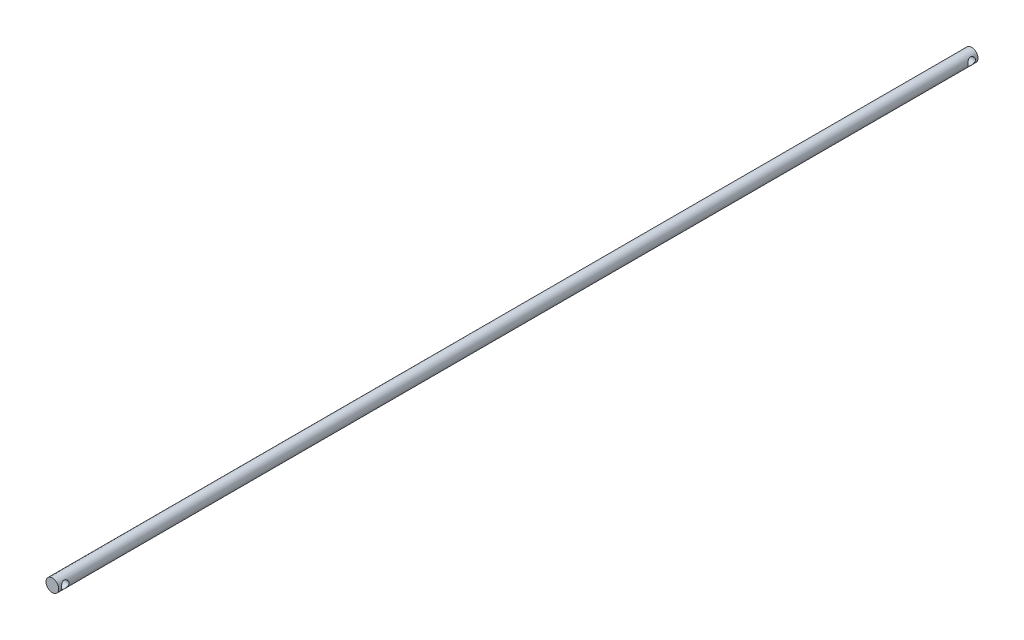
ISO-10303-21;
HEADER;
FILE_DESCRIPTION(('STEP AP214'),'2;1');
FILE_NAME('part.step','',(''),(''),'','','');
FILE_SCHEMA(('AUTOMOTIVE_DESIGN { 1 0 10303 214 1 1 1 1 }'));
ENDSEC;
DATA;
#1=APPLICATION_CONTEXT('core data for automotive mechanical design processes');
#2=APPLICATION_PROTOCOL_DEFINITION('international standard','automotive_design',2000,#1);
#3=PRODUCT_CONTEXT('',#1,'mechanical');
#4=PRODUCT('Part','Part','',(#3));
#5=PRODUCT_RELATED_PRODUCT_CATEGORY('part','',(#4));
#6=PRODUCT_DEFINITION_FORMATION('','',#4);
#7=PRODUCT_DEFINITION_CONTEXT('part definition',#1,'design');
#8=PRODUCT_DEFINITION('design','',#6,#7);
#9=PRODUCT_DEFINITION_SHAPE('','',#8);
#10=(LENGTH_UNIT() NAMED_UNIT(*) SI_UNIT(.MILLI.,.METRE.));
#11=(NAMED_UNIT(*) PLANE_ANGLE_UNIT() SI_UNIT($,.RADIAN.));
#12=(NAMED_UNIT(*) SI_UNIT($,.STERADIAN.) SOLID_ANGLE_UNIT());
#13=UNCERTAINTY_MEASURE_WITH_UNIT(LENGTH_MEASURE(1.E-05),#10,'distance_accuracy_value','');
#14=(GEOMETRIC_REPRESENTATION_CONTEXT(3) GLOBAL_UNCERTAINTY_ASSIGNED_CONTEXT((#13)) GLOBAL_UNIT_ASSIGNED_CONTEXT((#10,
#11,#12)) REPRESENTATION_CONTEXT('',''));
#15=CARTESIAN_POINT('',(0.,0.,0.));
#16=DIRECTION('',(0.,0.,1.));
#17=DIRECTION('',(1.,0.,0.));
#18=AXIS2_PLACEMENT_3D('',#15,#16,#17);
#19=CARTESIAN_POINT('',(0.,0.,360.));
#20=DIRECTION('',(0.,0.,-1.));
#21=DIRECTION('',(-1.,0.,0.));
#22=AXIS2_PLACEMENT_3D('',#19,#20,#21);
#23=CYLINDRICAL_SURFACE('',#22,2.5);
#24=CARTESIAN_POINT('',(-2.5,0.,355.935271275147));
#25=CARTESIAN_POINT('',(-2.49999625789732,0.0767298334620175,355.935275366156));
#26=CARTESIAN_POINT('',(-2.4964290461501,0.153582320644183,355.941199946073));
#27=CARTESIAN_POINT('',(-2.48249903608567,0.30497550953069,355.964595594662));
#28=CARTESIAN_POINT('',(-2.47211948032718,0.37951003459606,355.982095137001));
#29=CARTESIAN_POINT('',(-2.44561558054488,0.523751827790841,356.027657636313));
#30=CARTESIAN_POINT('',(-2.42951973272944,0.593481028226558,356.05566823331));
#31=CARTESIAN_POINT('',(-2.39295367626407,0.727030318214654,356.121131608288));
#32=CARTESIAN_POINT('',(-2.37248455380254,0.790851869416392,356.158582042115));
#33=CARTESIAN_POINT('',(-2.32705360719087,0.91629927899934,356.245046101855));
#34=CARTESIAN_POINT('',(-2.30186792195984,0.977384020081438,356.294724970498));
#35=CARTESIAN_POINT('',(-2.25030439279633,1.09088270411892,356.402738478975));
#36=CARTESIAN_POINT('',(-2.2239250515357,1.14328534948113,356.461084212334));
#37=CARTESIAN_POINT('',(-2.1691106699591,1.24444996762975,356.593194785643));
#38=CARTESIAN_POINT('',(-2.14082017703648,1.2919776637881,356.667973046128));
#39=CARTESIAN_POINT('',(-2.08938301412122,1.37361437764898,356.82611784839));
#40=CARTESIAN_POINT('',(-2.06622802273936,1.40774517335162,356.909470171394));
#41=CARTESIAN_POINT('',(-2.03354629660928,1.45440601714224,357.0618677258));
#42=CARTESIAN_POINT('',(-2.02207883137589,1.47016197246829,357.129507273757));
#43=CARTESIAN_POINT('',(-2.00590308295501,1.49216172340478,357.267074990977));
#44=CARTESIAN_POINT('',(-2.00118639643758,1.49841734556838,357.337000203901));
#45=CARTESIAN_POINT('',(-1.99920922463854,1.50105508796011,357.477282769364));
#46=CARTESIAN_POINT('',(-2.00196337012716,1.49741783408421,357.54764070024));
#47=CARTESIAN_POINT('',(-2.01453261443739,1.48046060478831,357.686550050574));
#48=CARTESIAN_POINT('',(-2.02435302432224,1.46713334620105,357.755100070994));
#49=CARTESIAN_POINT('',(-2.04953186944256,1.43173921881795,357.887801517275));
#50=CARTESIAN_POINT('',(-2.06481711652535,1.4097874866609,357.951998329071));
#51=CARTESIAN_POINT('',(-2.09927051350825,1.35795061770842,358.075966266075));
#52=CARTESIAN_POINT('',(-2.11844008623462,1.3280625725971,358.13573575857));
#53=CARTESIAN_POINT('',(-2.16255327268981,1.25517983184589,358.260255372269));
#54=CARTESIAN_POINT('',(-2.18792043372988,1.21080724397731,358.324049368101));
#55=CARTESIAN_POINT('',(-2.23930599764377,1.11291092784012,358.443947758814));
#56=CARTESIAN_POINT('',(-2.26532500262145,1.05937845100587,358.500044709123));
#57=CARTESIAN_POINT('',(-2.31935504958314,0.935811834383042,358.610884256968));
#58=CARTESIAN_POINT('',(-2.3471383626853,0.864517682705036,358.664348581163));
#59=CARTESIAN_POINT('',(-2.39772428433978,0.712276050459076,358.758393322344));
#60=CARTESIAN_POINT('',(-2.42052955425513,0.631333763943633,358.798980628936));
#61=CARTESIAN_POINT('',(-2.4573039206615,0.46719758526827,358.863203457942));
#62=CARTESIAN_POINT('',(-2.47173957439703,0.384467624173644,358.887746630862));
#63=CARTESIAN_POINT('',(-2.4921884281355,0.215047895144702,358.922282472552));
#64=CARTESIAN_POINT('',(-2.49821172952737,0.12836300566138,358.9322925929));
#65=CARTESIAN_POINT('',(-2.5009057037461,-0.0337146143773399,358.936779122825));
#66=CARTESIAN_POINT('',(-2.49873521714286,-0.109042473418664,358.933180130232));
#67=CARTESIAN_POINT('',(-2.48778712087049,-0.257829401986009,358.914845422075));
#68=CARTESIAN_POINT('',(-2.47900964518038,-0.331288509376054,358.900109932341));
#69=CARTESIAN_POINT('',(-2.45594792442191,-0.472574932157559,358.860727842334));
#70=CARTESIAN_POINT('',(-2.44180275662556,-0.540495750928427,358.836330926073));
#71=CARTESIAN_POINT('',(-2.40913880862846,-0.671265749087212,358.778593898781));
#72=CARTESIAN_POINT('',(-2.39061916586513,-0.734113924963864,358.7452520238));
#73=CARTESIAN_POINT('',(-2.34845496237362,-0.860006262823816,358.666714295938));
#74=CARTESIAN_POINT('',(-2.32447802739882,-0.92239415045678,358.620647446068));
#75=CARTESIAN_POINT('',(-2.27474265574734,-1.03902603131009,358.519879881658));
#76=CARTESIAN_POINT('',(-2.24898216586362,-1.09326040273736,358.465169120294));
#77=CARTESIAN_POINT('',(-2.19445423909892,-1.19931996735578,358.34036088511));
#78=CARTESIAN_POINT('',(-2.16573241746293,-1.24991019630912,358.269187389681));
#79=CARTESIAN_POINT('',(-2.11216182066712,-1.33845238915664,358.118055250578));
#80=CARTESIAN_POINT('',(-2.08730897997691,-1.37641766769779,358.038105981254));
#81=CARTESIAN_POINT('',(-2.04984909240519,-1.43142578795776,357.88902825284));
#82=CARTESIAN_POINT('',(-2.03575659328728,-1.45121625336191,357.821290962788));
#83=CARTESIAN_POINT('',(-2.01409605743543,-1.48113663905973,357.682739197067));
#84=CARTESIAN_POINT('',(-2.0065189764272,-1.49127995297632,357.611929130819));
#85=CARTESIAN_POINT('',(-1.99900446616266,-1.50134130416633,357.46889432755));
#86=CARTESIAN_POINT('',(-1.99909576445935,-1.50122089107872,357.39666528446));
#87=CARTESIAN_POINT('',(-2.00697717892848,-1.4906647295933,357.253376839537));
#88=CARTESIAN_POINT('',(-2.01477148138818,-1.48022337215761,357.182318095066));
#89=CARTESIAN_POINT('',(-2.03633185242978,-1.45040174148915,357.046782857574));
#90=CARTESIAN_POINT('',(-2.04979211805579,-1.43147636845353,356.98215418084));
#91=CARTESIAN_POINT('',(-2.0810550196015,-1.38563242076995,356.856934020672));
#92=CARTESIAN_POINT('',(-2.09885929040481,-1.35871083588482,356.796344068186));
#93=CARTESIAN_POINT('',(-2.14012990550915,-1.29289245555735,356.670951417926));
#94=CARTESIAN_POINT('',(-2.16404587582638,-1.25279167675756,356.606930171292));
#95=CARTESIAN_POINT('',(-2.21320127030766,-1.16375698389088,356.485891202529));
#96=CARTESIAN_POINT('',(-2.23844177205019,-1.11481579607802,356.428879312994));
#97=CARTESIAN_POINT('',(-2.29225690291474,-1.00009777425738,356.313920326015));
#98=CARTESIAN_POINT('',(-2.32070308663656,-0.932876819313945,356.25734020025));
#99=CARTESIAN_POINT('',(-2.37365428872366,-0.788462434445632,356.156173419283));
#100=CARTESIAN_POINT('',(-2.39815789310934,-0.711265444501585,356.111591063162));
#101=CARTESIAN_POINT('',(-2.43985578654393,-0.551125230801487,356.037485467573));
#102=CARTESIAN_POINT('',(-2.45725077479786,-0.468430086957234,356.00754321022));
#103=CARTESIAN_POINT('',(-2.48366273001246,-0.297973306118822,355.962546579936));
#104=CARTESIAN_POINT('',(-2.49271125871485,-0.210232099648635,355.947436107289));
#105=CARTESIAN_POINT('',(-2.49802001168187,-0.101558096917556,355.938573820438));
#106=CARTESIAN_POINT('',(-2.49876114656362,-0.0812762590282931,355.93733685784));
#107=CARTESIAN_POINT('',(-2.49975164517367,-0.0406658206871201,355.935685028776));
#108=CARTESIAN_POINT('',(-2.50000099184316,-0.0203372186375734,355.935270190826));
#109=CARTESIAN_POINT('',(-2.5,0.,355.935271275147));
#110=B_SPLINE_CURVE_WITH_KNOTS('',3,(#24,#25,#26,#27,#28,#29,#30,#31,#32,#33,#34,#35,#36,#37,
#38,#39,#40,#41,#42,#43,#44,#45,#46,#47,#48,#49,#50,#51,#52,#53,#54,#55,#56,#57,#58,#59,#60,#61,
#62,#63,#64,#65,#66,#67,#68,#69,#70,#71,#72,#73,#74,#75,#76,#77,#78,#79,#80,#81,#82,#83,#84,#85,
#86,#87,#88,#89,#90,#91,#92,#93,#94,#95,#96,#97,#98,#99,#100,#101,#102,#103,#104,#105,#106,#107,
#108,#109),.UNSPECIFIED.,.T.,.F.,(4,2,2,2,2,2,2,2,2,2,2,2,2,2,2,2,2,2,2,2,2,2,2,2,2,2,2,2,2,2,2,
2,2,2,2,2,2,2,2,2,2,2,4),(0.,0.230102237548654,0.46077262752002,0.690308884600017,
0.919788197992278,1.16681590732477,1.41416257934802,1.69183813189808,1.96906040692097,
2.17933829855637,2.38935420916578,2.59978170870725,2.81036753273876,3.01823267593204,
3.22617409809866,3.47046995225159,3.71500044803672,3.9936095788469,4.27206939275324,
4.53296790696561,4.79355286918237,5.01875602722429,5.24395461863457,5.46367785689772,
5.68344445659026,5.92601365818363,6.1688669008184,6.4433676242801,6.71757792616458,
6.93257787314697,7.14727888733324,7.36278425777444,7.57840681155737,7.78364098331153,
7.98895251523051,8.22578610052296,8.4628154437022,8.73854311775528,9.01436946031996,
9.28175654462691,9.54812832184462,9.60911473335192,9.67010326027656),.UNSPECIFIED.);
#111=CARTESIAN_POINT('',(-2.5,0.,355.935271275147));
#112=VERTEX_POINT('',#111);
#113=EDGE_CURVE('E10',#112,#112,#110,.T.);
#114=ORIENTED_EDGE('',*,*,#113,.T.);
#115=EDGE_LOOP('',(#114));
#116=FACE_BOUND('',#115,.T.);
#117=CARTESIAN_POINT('',(2.5,0.,355.935271275147));
#118=CARTESIAN_POINT('',(2.49999625789732,-0.0767298334620175,355.935275366156));
#119=CARTESIAN_POINT('',(2.4964290461501,-0.153582320644183,355.941199946073));
#120=CARTESIAN_POINT('',(2.48249903608567,-0.30497550953069,355.964595594662));
#121=CARTESIAN_POINT('',(2.47211948032718,-0.37951003459606,355.982095137001));
#122=CARTESIAN_POINT('',(2.44561558054488,-0.523751827790841,356.027657636313));
#123=CARTESIAN_POINT('',(2.42951973272944,-0.593481028226558,356.05566823331));
#124=CARTESIAN_POINT('',(2.39295367626407,-0.727030318214654,356.121131608288));
#125=CARTESIAN_POINT('',(2.37248455380254,-0.790851869416392,356.158582042115));
#126=CARTESIAN_POINT('',(2.32705360719087,-0.91629927899934,356.245046101855));
#127=CARTESIAN_POINT('',(2.30186792195984,-0.977384020081438,356.294724970498));
#128=CARTESIAN_POINT('',(2.25030439279633,-1.09088270411892,356.402738478975));
#129=CARTESIAN_POINT('',(2.2239250515357,-1.14328534948113,356.461084212334));
#130=CARTESIAN_POINT('',(2.1691106699591,-1.24444996762975,356.593194785643));
#131=CARTESIAN_POINT('',(2.14082017703648,-1.2919776637881,356.667973046128));
#132=CARTESIAN_POINT('',(2.08938301412122,-1.37361437764898,356.82611784839));
#133=CARTESIAN_POINT('',(2.06622802273936,-1.40774517335162,356.909470171394));
#134=CARTESIAN_POINT('',(2.03354629660928,-1.45440601714224,357.0618677258));
#135=CARTESIAN_POINT('',(2.02207883137589,-1.47016197246829,357.129507273757));
#136=CARTESIAN_POINT('',(2.00590308295501,-1.49216172340478,357.267074990977));
#137=CARTESIAN_POINT('',(2.00118639643758,-1.49841734556838,357.337000203901));
#138=CARTESIAN_POINT('',(1.99920922463854,-1.50105508796011,357.477282769364));
#139=CARTESIAN_POINT('',(2.00196337012716,-1.49741783408421,357.54764070024));
#140=CARTESIAN_POINT('',(2.01453261443739,-1.48046060478831,357.686550050574));
#141=CARTESIAN_POINT('',(2.02435302432224,-1.46713334620105,357.755100070994));
#142=CARTESIAN_POINT('',(2.04953186944256,-1.43173921881795,357.887801517275));
#143=CARTESIAN_POINT('',(2.06481711652535,-1.4097874866609,357.951998329071));
#144=CARTESIAN_POINT('',(2.09927051350825,-1.35795061770842,358.075966266075));
#145=CARTESIAN_POINT('',(2.11844008623462,-1.3280625725971,358.13573575857));
#146=CARTESIAN_POINT('',(2.16255327268981,-1.25517983184589,358.260255372269));
#147=CARTESIAN_POINT('',(2.18792043372988,-1.21080724397731,358.324049368101));
#148=CARTESIAN_POINT('',(2.23930599764377,-1.11291092784012,358.443947758814));
#149=CARTESIAN_POINT('',(2.26532500262145,-1.05937845100587,358.500044709123));
#150=CARTESIAN_POINT('',(2.31935504958314,-0.935811834383042,358.610884256968));
#151=CARTESIAN_POINT('',(2.3471383626853,-0.864517682705036,358.664348581163));
#152=CARTESIAN_POINT('',(2.39772428433978,-0.712276050459076,358.758393322344));
#153=CARTESIAN_POINT('',(2.42052955425513,-0.631333763943633,358.798980628936));
#154=CARTESIAN_POINT('',(2.4573039206615,-0.46719758526827,358.863203457942));
#155=CARTESIAN_POINT('',(2.47173957439703,-0.384467624173644,358.887746630862));
#156=CARTESIAN_POINT('',(2.4921884281355,-0.215047895144702,358.922282472552));
#157=CARTESIAN_POINT('',(2.49821172952737,-0.12836300566138,358.9322925929));
#158=CARTESIAN_POINT('',(2.5009057037461,0.0337146143773399,358.936779122825));
#159=CARTESIAN_POINT('',(2.49873521714286,0.109042473418664,358.933180130232));
#160=CARTESIAN_POINT('',(2.48778712087049,0.257829401986009,358.914845422075));
#161=CARTESIAN_POINT('',(2.47900964518038,0.331288509376054,358.900109932341));
#162=CARTESIAN_POINT('',(2.45594792442191,0.472574932157559,358.860727842334));
#163=CARTESIAN_POINT('',(2.44180275662556,0.540495750928427,358.836330926073));
#164=CARTESIAN_POINT('',(2.40913880862846,0.671265749087212,358.778593898781));
#165=CARTESIAN_POINT('',(2.39061916586513,0.734113924963864,358.7452520238));
#166=CARTESIAN_POINT('',(2.34845496237362,0.860006262823816,358.666714295938));
#167=CARTESIAN_POINT('',(2.32447802739882,0.92239415045678,358.620647446068));
#168=CARTESIAN_POINT('',(2.27474265574734,1.03902603131009,358.519879881658));
#169=CARTESIAN_POINT('',(2.24898216586362,1.09326040273736,358.465169120294));
#170=CARTESIAN_POINT('',(2.19445423909892,1.19931996735578,358.34036088511));
#171=CARTESIAN_POINT('',(2.16573241746293,1.24991019630912,358.269187389681));
#172=CARTESIAN_POINT('',(2.11216182066712,1.33845238915664,358.118055250578));
#173=CARTESIAN_POINT('',(2.08730897997691,1.37641766769779,358.038105981254));
#174=CARTESIAN_POINT('',(2.04984909240519,1.43142578795776,357.88902825284));
#175=CARTESIAN_POINT('',(2.03575659328728,1.45121625336191,357.821290962788));
#176=CARTESIAN_POINT('',(2.01409605743543,1.48113663905973,357.682739197067));
#177=CARTESIAN_POINT('',(2.0065189764272,1.49127995297632,357.611929130819));
#178=CARTESIAN_POINT('',(1.99900446616266,1.50134130416633,357.46889432755));
#179=CARTESIAN_POINT('',(1.99909576445935,1.50122089107872,357.39666528446));
#180=CARTESIAN_POINT('',(2.00697717892848,1.4906647295933,357.253376839537));
#181=CARTESIAN_POINT('',(2.01477148138818,1.48022337215761,357.182318095066));
#182=CARTESIAN_POINT('',(2.03633185242978,1.45040174148915,357.046782857574));
#183=CARTESIAN_POINT('',(2.04979211805579,1.43147636845353,356.98215418084));
#184=CARTESIAN_POINT('',(2.0810550196015,1.38563242076995,356.856934020672));
#185=CARTESIAN_POINT('',(2.09885929040481,1.35871083588482,356.796344068186));
#186=CARTESIAN_POINT('',(2.14012990550915,1.29289245555735,356.670951417926));
#187=CARTESIAN_POINT('',(2.16404587582638,1.25279167675756,356.606930171292));
#188=CARTESIAN_POINT('',(2.21320127030766,1.16375698389088,356.485891202529));
#189=CARTESIAN_POINT('',(2.23844177205019,1.11481579607802,356.428879312994));
#190=CARTESIAN_POINT('',(2.29225690291474,1.00009777425738,356.313920326015));
#191=CARTESIAN_POINT('',(2.32070308663656,0.932876819313945,356.25734020025));
#192=CARTESIAN_POINT('',(2.37365428872366,0.788462434445632,356.156173419283));
#193=CARTESIAN_POINT('',(2.39815789310934,0.711265444501585,356.111591063162));
#194=CARTESIAN_POINT('',(2.43985578654393,0.551125230801487,356.037485467573));
#195=CARTESIAN_POINT('',(2.45725077479786,0.468430086957234,356.00754321022));
#196=CARTESIAN_POINT('',(2.48366273001246,0.297973306118822,355.962546579936));
#197=CARTESIAN_POINT('',(2.49271125871485,0.210232099648635,355.947436107289));
#198=CARTESIAN_POINT('',(2.49802001168187,0.101558096917556,355.938573820438));
#199=CARTESIAN_POINT('',(2.49876114656362,0.0812762590282931,355.93733685784));
#200=CARTESIAN_POINT('',(2.49975164517367,0.0406658206871201,355.935685028776));
#201=CARTESIAN_POINT('',(2.50000099184316,0.0203372186375734,355.935270190826));
#202=CARTESIAN_POINT('',(2.5,0.,355.935271275147));
#203=B_SPLINE_CURVE_WITH_KNOTS('',3,(#117,#118,#119,#120,#121,#122,#123,#124,#125,#126,#127,
#128,#129,#130,#131,#132,#133,#134,#135,#136,#137,#138,#139,#140,#141,#142,#143,#144,#145,#146,
#147,#148,#149,#150,#151,#152,#153,#154,#155,#156,#157,#158,#159,#160,#161,#162,#163,#164,#165,
#166,#167,#168,#169,#170,#171,#172,#173,#174,#175,#176,#177,#178,#179,#180,#181,#182,#183,#184,
#185,#186,#187,#188,#189,#190,#191,#192,#193,#194,#195,#196,#197,#198,#199,#200,#201,#202),
.UNSPECIFIED.,.T.,.F.,(4,2,2,2,2,2,2,2,2,2,2,2,2,2,2,2,2,2,2,2,2,2,2,2,2,2,2,2,2,2,2,2,2,2,2,2,
2,2,2,2,2,2,4),(0.,0.230102237548654,0.46077262752002,0.690308884600017,0.919788197992278,
1.16681590732477,1.41416257934802,1.69183813189808,1.96906040692097,2.17933829855637,
2.38935420916578,2.59978170870725,2.81036753273876,3.01823267593204,3.22617409809866,
3.47046995225159,3.71500044803672,3.9936095788469,4.27206939275324,4.53296790696561,
4.79355286918237,5.01875602722429,5.24395461863457,5.46367785689772,5.68344445659026,
5.92601365818363,6.1688669008184,6.4433676242801,6.71757792616458,6.93257787314697,
7.14727888733324,7.36278425777444,7.57840681155737,7.78364098331153,7.98895251523051,
8.22578610052296,8.4628154437022,8.73854311775528,9.01436946031996,9.28175654462691,
9.54812832184462,9.60911473335192,9.67010326027656),.UNSPECIFIED.);
#204=CARTESIAN_POINT('',(2.5,0.,355.935271275147));
#205=VERTEX_POINT('',#204);
#206=EDGE_CURVE('E50',#205,#205,#203,.T.);
#207=ORIENTED_EDGE('',*,*,#206,.T.);
#208=EDGE_LOOP('',(#207));
#209=FACE_BOUND('',#208,.T.);
#210=CARTESIAN_POINT('',(-2.5,0.,0.995637839981524));
#211=CARTESIAN_POINT('',(-2.49999625789732,0.0767298334620168,0.995641930991403));
#212=CARTESIAN_POINT('',(-2.4964290461501,0.15358232064418,1.00156651090779));
#213=CARTESIAN_POINT('',(-2.48249903608568,0.304975509530683,1.02496215949685));
#214=CARTESIAN_POINT('',(-2.47211948032719,0.379510034596052,1.04246170183575));
#215=CARTESIAN_POINT('',(-2.44561558054488,0.523751827790843,1.08802420114838));
#216=CARTESIAN_POINT('',(-2.42951973272943,0.593481028226573,1.11603479814468));
#217=CARTESIAN_POINT('',(-2.39295367626407,0.727030318214667,1.18149817312256));
#218=CARTESIAN_POINT('',(-2.37248455380255,0.790851869416392,1.21894860695027));
#219=CARTESIAN_POINT('',(-2.32705360719087,0.916299278999325,1.30541266669011));
#220=CARTESIAN_POINT('',(-2.30186792195984,0.977384020081426,1.35509153533292));
#221=CARTESIAN_POINT('',(-2.25030439279633,1.09088270411892,1.46310504380981));
#222=CARTESIAN_POINT('',(-2.2239250515357,1.14328534948113,1.52145077716885));
#223=CARTESIAN_POINT('',(-2.1691106699591,1.24444996762975,1.65356135047827));
#224=CARTESIAN_POINT('',(-2.14082017703649,1.2919776637881,1.72833961096282));
#225=CARTESIAN_POINT('',(-2.08938301412123,1.37361437764897,1.88648441322465));
#226=CARTESIAN_POINT('',(-2.06622802273937,1.4077451733516,1.9698367362291));
#227=CARTESIAN_POINT('',(-2.0335462966093,1.45440601714222,2.12223429063477));
#228=CARTESIAN_POINT('',(-2.02207883137591,1.47016197246827,2.18987383859185));
#229=CARTESIAN_POINT('',(-2.00590308295503,1.49216172340475,2.32744155581189));
#230=CARTESIAN_POINT('',(-2.00118639643759,1.49841734556836,2.39736676873602));
#231=CARTESIAN_POINT('',(-1.99920922463856,1.50105508796009,2.53764933419886));
#232=CARTESIAN_POINT('',(-2.00196337012718,1.49741783408418,2.60800726507472));
#233=CARTESIAN_POINT('',(-2.01453261443741,1.48046060478828,2.74691661540911));
#234=CARTESIAN_POINT('',(-2.02435302432226,1.46713334620103,2.81546663582897));
#235=CARTESIAN_POINT('',(-2.04953186944258,1.43173921881792,2.94816808210963));
#236=CARTESIAN_POINT('',(-2.06481711652537,1.40978748666087,3.01236489390601));
#237=CARTESIAN_POINT('',(-2.09927051350828,1.35795061770837,3.13633283090965));
#238=CARTESIAN_POINT('',(-2.11844008623465,1.32806257259705,3.19610232340545));
#239=CARTESIAN_POINT('',(-2.16255327268985,1.25517983184582,3.32062193710433));
#240=CARTESIAN_POINT('',(-2.18792043372992,1.21080724397722,3.38441593293646));
#241=CARTESIAN_POINT('',(-2.23930599764382,1.11291092784002,3.50431432364855));
#242=CARTESIAN_POINT('',(-2.2653250026215,1.05937845100577,3.56041127395804));
#243=CARTESIAN_POINT('',(-2.31935504958317,0.935811834382947,3.6712508218033));
#244=CARTESIAN_POINT('',(-2.34713836268533,0.864517682704935,3.72471514599753));
#245=CARTESIAN_POINT('',(-2.39772428433981,0.712276050458972,3.81875988717945));
#246=CARTESIAN_POINT('',(-2.42052955425516,0.631333763943532,3.85934719377149));
#247=CARTESIAN_POINT('',(-2.45730392066152,0.467197585268171,3.92357002277743));
#248=CARTESIAN_POINT('',(-2.47173957439704,0.384467624173545,3.94811319569745));
#249=CARTESIAN_POINT('',(-2.49218842813551,0.215047895144605,3.98264903738691));
#250=CARTESIAN_POINT('',(-2.49821172952738,0.128363005661285,3.9926591577351));
#251=CARTESIAN_POINT('',(-2.5009057037461,-0.0337146143774281,3.99714568765983));
#252=CARTESIAN_POINT('',(-2.49873521714286,-0.109042473418747,3.99354669506669));
#253=CARTESIAN_POINT('',(-2.48778712087048,-0.257829401986086,3.9752119869096));
#254=CARTESIAN_POINT('',(-2.47900964518037,-0.331288509376129,3.96047649717571));
#255=CARTESIAN_POINT('',(-2.4559479244219,-0.472574932157632,3.92109440716905));
#256=CARTESIAN_POINT('',(-2.44180275662555,-0.540495750928502,3.89669749090805));
#257=CARTESIAN_POINT('',(-2.40913880862844,-0.671265749087278,3.83896046361625));
#258=CARTESIAN_POINT('',(-2.39061916586511,-0.734113924963922,3.80561858863484));
#259=CARTESIAN_POINT('',(-2.3484549623736,-0.860006262823875,3.72708086077281));
#260=CARTESIAN_POINT('',(-2.32447802739879,-0.922394150456848,3.68101401090312));
#261=CARTESIAN_POINT('',(-2.27474265574731,-1.03902603131015,3.5802464464929));
#262=CARTESIAN_POINT('',(-2.2489821658636,-1.09326040273739,3.52553568512898));
#263=CARTESIAN_POINT('',(-2.1944542390989,-1.1993199673558,3.40072744994436));
#264=CARTESIAN_POINT('',(-2.16573241746291,-1.24991019630916,3.32955395451601));
#265=CARTESIAN_POINT('',(-2.11216182066709,-1.33845238915668,3.1784218154133));
#266=CARTESIAN_POINT('',(-2.08730897997689,-1.37641766769782,3.09847254608872));
#267=CARTESIAN_POINT('',(-2.04984909240519,-1.43142578795777,2.94939481767481));
#268=CARTESIAN_POINT('',(-2.03575659328728,-1.45121625336191,2.88165752762291));
#269=CARTESIAN_POINT('',(-2.01409605743543,-1.48113663905972,2.7431057619014));
#270=CARTESIAN_POINT('',(-2.0065189764272,-1.49127995297631,2.67229569565367));
#271=CARTESIAN_POINT('',(-1.99900446616268,-1.50134130416631,2.52926089238447));
#272=CARTESIAN_POINT('',(-1.99909576445937,-1.50122089107869,2.45703184929445));
#273=CARTESIAN_POINT('',(-2.0069771789285,-1.49066472959327,2.31374340437204));
#274=CARTESIAN_POINT('',(-2.01477148138821,-1.48022337215758,2.2426846599009));
#275=CARTESIAN_POINT('',(-2.03633185242981,-1.45040174148912,2.10714942240931));
#276=CARTESIAN_POINT('',(-2.04979211805581,-1.4314763684535,2.04252074567463));
#277=CARTESIAN_POINT('',(-2.08105501960152,-1.38563242076992,1.91730058550728));
#278=CARTESIAN_POINT('',(-2.09885929040483,-1.35871083588478,1.85671063302095));
#279=CARTESIAN_POINT('',(-2.14012990550917,-1.29289245555731,1.73131798276072));
#280=CARTESIAN_POINT('',(-2.1640458758264,-1.25279167675752,1.6672967361272));
#281=CARTESIAN_POINT('',(-2.21320127030768,-1.16375698389083,1.54625776736422));
#282=CARTESIAN_POINT('',(-2.23844177205022,-1.11481579607797,1.48924587782896));
#283=CARTESIAN_POINT('',(-2.29225690291477,-1.00009777425733,1.37428689084984));
#284=CARTESIAN_POINT('',(-2.32070308663658,-0.932876819313896,1.31770676508533));
#285=CARTESIAN_POINT('',(-2.37365428872367,-0.788462434445585,1.21653998411822));
#286=CARTESIAN_POINT('',(-2.39815789310936,-0.711265444501538,1.17195762799673));
#287=CARTESIAN_POINT('',(-2.43985578654394,-0.551125230801454,1.09785203240779));
#288=CARTESIAN_POINT('',(-2.45725077479787,-0.468430086957215,1.0679097750547));
#289=CARTESIAN_POINT('',(-2.48366273001246,-0.297973306118809,1.02291314477055));
#290=CARTESIAN_POINT('',(-2.49271125871485,-0.210232099648615,1.00780267212453));
#291=CARTESIAN_POINT('',(-2.49802001168187,-0.101558096917538,0.998940385272865));
#292=CARTESIAN_POINT('',(-2.49876114656362,-0.0812762590282788,0.997703422675428));
#293=CARTESIAN_POINT('',(-2.49975164517367,-0.0406658206871127,0.99605159361066));
#294=CARTESIAN_POINT('',(-2.50000099184316,-0.0203372186375696,0.99563675566062));
#295=CARTESIAN_POINT('',(-2.5,0.,0.995637839981524));
#296=B_SPLINE_CURVE_WITH_KNOTS('',3,(#210,#211,#212,#213,#214,#215,#216,#217,#218,#219,#220,
#221,#222,#223,#224,#225,#226,#227,#228,#229,#230,#231,#232,#233,#234,#235,#236,#237,#238,#239,
#240,#241,#242,#243,#244,#245,#246,#247,#248,#249,#250,#251,#252,#253,#254,#255,#256,#257,#258,
#259,#260,#261,#262,#263,#264,#265,#266,#267,#268,#269,#270,#271,#272,#273,#274,#275,#276,#277,
#278,#279,#280,#281,#282,#283,#284,#285,#286,#287,#288,#289,#290,#291,#292,#293,#294,#295),
.UNSPECIFIED.,.T.,.F.,(4,2,2,2,2,2,2,2,2,2,2,2,2,2,2,2,2,2,2,2,2,2,2,2,2,2,2,2,2,2,2,2,2,2,2,2,
2,2,2,2,2,2,4),(0.,0.230102237548652,0.460772627520018,0.690308884600021,0.919788197992287,
1.16681590732474,1.41416257934802,1.69183813189809,1.96906040692092,2.17933829855634,
2.38935420916578,2.59978170870726,2.81036753273872,3.01823267593207,3.22617409809869,
3.47046995225164,3.71500044803676,3.99360957884694,4.27206939275328,4.53296790696563,
4.79355286918239,5.01875602722429,5.24395461863457,5.46367785689774,5.68344445659027,
5.92601365818363,6.16886690081837,6.44336762428011,6.71757792616458,6.93257787314695,
7.14727888733321,7.36278425777436,7.57840681155728,7.78364098331145,7.98895251523038,
8.22578610052288,8.46281544370209,8.7385431177552,9.01436946031985,9.28175654462677,
9.54812832184448,9.60911473335177,9.67010326027641),.UNSPECIFIED.);
#297=CARTESIAN_POINT('',(-2.5,0.,0.995637839981524));
#298=VERTEX_POINT('',#297);
#299=EDGE_CURVE('E54',#298,#298,#296,.T.);
#300=ORIENTED_EDGE('',*,*,#299,.T.);
#301=EDGE_LOOP('',(#300));
#302=FACE_BOUND('',#301,.T.);
#303=CARTESIAN_POINT('',(2.5,0.,0.995637839981524));
#304=CARTESIAN_POINT('',(2.49999625789732,-0.0767298334620168,0.995641930991403));
#305=CARTESIAN_POINT('',(2.4964290461501,-0.15358232064418,1.00156651090779));
#306=CARTESIAN_POINT('',(2.48249903608568,-0.304975509530683,1.02496215949685));
#307=CARTESIAN_POINT('',(2.47211948032719,-0.379510034596052,1.04246170183575));
#308=CARTESIAN_POINT('',(2.44561558054488,-0.523751827790843,1.08802420114838));
#309=CARTESIAN_POINT('',(2.42951973272943,-0.593481028226573,1.11603479814468));
#310=CARTESIAN_POINT('',(2.39295367626407,-0.727030318214667,1.18149817312256));
#311=CARTESIAN_POINT('',(2.37248455380255,-0.790851869416392,1.21894860695027));
#312=CARTESIAN_POINT('',(2.32705360719087,-0.916299278999325,1.30541266669011));
#313=CARTESIAN_POINT('',(2.30186792195985,-0.977384020081425,1.35509153533292));
#314=CARTESIAN_POINT('',(2.25030439279633,-1.09088270411892,1.46310504380981));
#315=CARTESIAN_POINT('',(2.2239250515357,-1.14328534948113,1.52145077716885));
#316=CARTESIAN_POINT('',(2.1691106699591,-1.24444996762975,1.65356135047827));
#317=CARTESIAN_POINT('',(2.14082017703649,-1.2919776637881,1.72833961096282));
#318=CARTESIAN_POINT('',(2.08938301412123,-1.37361437764897,1.88648441322465));
#319=CARTESIAN_POINT('',(2.06622802273937,-1.4077451733516,1.9698367362291));
#320=CARTESIAN_POINT('',(2.0335462966093,-1.45440601714222,2.12223429063477));
#321=CARTESIAN_POINT('',(2.02207883137591,-1.47016197246827,2.18987383859185));
#322=CARTESIAN_POINT('',(2.00590308295503,-1.49216172340475,2.32744155581189));
#323=CARTESIAN_POINT('',(2.00118639643759,-1.49841734556836,2.39736676873602));
#324=CARTESIAN_POINT('',(1.99920922463856,-1.50105508796009,2.53764933419886));
#325=CARTESIAN_POINT('',(2.00196337012718,-1.49741783408419,2.60800726507472));
#326=CARTESIAN_POINT('',(2.01453261443741,-1.48046060478828,2.74691661540911));
#327=CARTESIAN_POINT('',(2.02435302432226,-1.46713334620103,2.81546663582897));
#328=CARTESIAN_POINT('',(2.04953186944258,-1.43173921881792,2.94816808210963));
#329=CARTESIAN_POINT('',(2.06481711652537,-1.40978748666087,3.01236489390601));
#330=CARTESIAN_POINT('',(2.09927051350828,-1.35795061770837,3.13633283090965));
#331=CARTESIAN_POINT('',(2.11844008623465,-1.32806257259705,3.19610232340545));
#332=CARTESIAN_POINT('',(2.16255327268985,-1.25517983184582,3.32062193710433));
#333=CARTESIAN_POINT('',(2.18792043372992,-1.21080724397722,3.38441593293646));
#334=CARTESIAN_POINT('',(2.23930599764382,-1.11291092784002,3.50431432364855));
#335=CARTESIAN_POINT('',(2.2653250026215,-1.05937845100577,3.56041127395804));
#336=CARTESIAN_POINT('',(2.31935504958317,-0.935811834382947,3.6712508218033));
#337=CARTESIAN_POINT('',(2.34713836268533,-0.864517682704935,3.72471514599753));
#338=CARTESIAN_POINT('',(2.39772428433981,-0.712276050458972,3.81875988717945));
#339=CARTESIAN_POINT('',(2.42052955425516,-0.631333763943532,3.85934719377149));
#340=CARTESIAN_POINT('',(2.45730392066152,-0.467197585268171,3.92357002277743));
#341=CARTESIAN_POINT('',(2.47173957439704,-0.384467624173545,3.94811319569745));
#342=CARTESIAN_POINT('',(2.49218842813551,-0.215047895144605,3.98264903738691));
#343=CARTESIAN_POINT('',(2.49821172952738,-0.128363005661285,3.9926591577351));
#344=CARTESIAN_POINT('',(2.5009057037461,0.0337146143774282,3.99714568765983));
#345=CARTESIAN_POINT('',(2.49873521714286,0.109042473418748,3.99354669506669));
#346=CARTESIAN_POINT('',(2.48778712087048,0.257829401986086,3.9752119869096));
#347=CARTESIAN_POINT('',(2.47900964518037,0.331288509376129,3.96047649717571));
#348=CARTESIAN_POINT('',(2.4559479244219,0.472574932157632,3.92109440716905));
#349=CARTESIAN_POINT('',(2.44180275662555,0.540495750928502,3.89669749090805));
#350=CARTESIAN_POINT('',(2.40913880862844,0.671265749087278,3.83896046361625));
#351=CARTESIAN_POINT('',(2.39061916586511,0.734113924963922,3.80561858863484));
#352=CARTESIAN_POINT('',(2.3484549623736,0.860006262823875,3.72708086077281));
#353=CARTESIAN_POINT('',(2.32447802739879,0.922394150456848,3.68101401090312));
#354=CARTESIAN_POINT('',(2.27474265574731,1.03902603131015,3.5802464464929));
#355=CARTESIAN_POINT('',(2.2489821658636,1.09326040273739,3.52553568512898));
#356=CARTESIAN_POINT('',(2.1944542390989,1.1993199673558,3.40072744994436));
#357=CARTESIAN_POINT('',(2.16573241746291,1.24991019630916,3.32955395451601));
#358=CARTESIAN_POINT('',(2.11216182066709,1.33845238915668,3.1784218154133));
#359=CARTESIAN_POINT('',(2.08730897997689,1.37641766769782,3.09847254608872));
#360=CARTESIAN_POINT('',(2.04984909240519,1.43142578795777,2.94939481767481));
#361=CARTESIAN_POINT('',(2.03575659328728,1.45121625336191,2.88165752762291));
#362=CARTESIAN_POINT('',(2.01409605743543,1.48113663905972,2.7431057619014));
#363=CARTESIAN_POINT('',(2.0065189764272,1.49127995297631,2.67229569565367));
#364=CARTESIAN_POINT('',(1.99900446616267,1.50134130416631,2.52926089238446));
#365=CARTESIAN_POINT('',(1.99909576445937,1.50122089107869,2.45703184929445));
#366=CARTESIAN_POINT('',(2.0069771789285,1.49066472959327,2.31374340437204));
#367=CARTESIAN_POINT('',(2.01477148138821,1.48022337215758,2.2426846599009));
#368=CARTESIAN_POINT('',(2.03633185242981,1.45040174148912,2.10714942240931));
#369=CARTESIAN_POINT('',(2.04979211805581,1.4314763684535,2.04252074567463));
#370=CARTESIAN_POINT('',(2.08105501960152,1.38563242076992,1.91730058550728));
#371=CARTESIAN_POINT('',(2.09885929040483,1.35871083588478,1.85671063302095));
#372=CARTESIAN_POINT('',(2.14012990550917,1.29289245555731,1.73131798276072));
#373=CARTESIAN_POINT('',(2.1640458758264,1.25279167675752,1.6672967361272));
#374=CARTESIAN_POINT('',(2.21320127030768,1.16375698389083,1.54625776736422));
#375=CARTESIAN_POINT('',(2.23844177205022,1.11481579607797,1.48924587782895));
#376=CARTESIAN_POINT('',(2.29225690291477,1.00009777425733,1.37428689084984));
#377=CARTESIAN_POINT('',(2.32070308663658,0.932876819313896,1.31770676508533));
#378=CARTESIAN_POINT('',(2.37365428872367,0.788462434445584,1.21653998411821));
#379=CARTESIAN_POINT('',(2.39815789310936,0.711265444501537,1.17195762799673));
#380=CARTESIAN_POINT('',(2.43985578654394,0.551125230801452,1.09785203240779));
#381=CARTESIAN_POINT('',(2.45725077479787,0.468430086957213,1.0679097750547));
#382=CARTESIAN_POINT('',(2.48366273001246,0.297973306118808,1.02291314477055));
#383=CARTESIAN_POINT('',(2.49271125871485,0.210232099648613,1.00780267212453));
#384=CARTESIAN_POINT('',(2.49802001168187,0.101558096917537,0.998940385272865));
#385=CARTESIAN_POINT('',(2.49876114656362,0.0812762590282778,0.997703422675428));
#386=CARTESIAN_POINT('',(2.49975164517367,0.0406658206871122,0.99605159361066));
#387=CARTESIAN_POINT('',(2.50000099184316,0.0203372186375694,0.99563675566062));
#388=CARTESIAN_POINT('',(2.5,0.,0.995637839981524));
#389=B_SPLINE_CURVE_WITH_KNOTS('',3,(#303,#304,#305,#306,#307,#308,#309,#310,#311,#312,#313,
#314,#315,#316,#317,#318,#319,#320,#321,#322,#323,#324,#325,#326,#327,#328,#329,#330,#331,#332,
#333,#334,#335,#336,#337,#338,#339,#340,#341,#342,#343,#344,#345,#346,#347,#348,#349,#350,#351,
#352,#353,#354,#355,#356,#357,#358,#359,#360,#361,#362,#363,#364,#365,#366,#367,#368,#369,#370,
#371,#372,#373,#374,#375,#376,#377,#378,#379,#380,#381,#382,#383,#384,#385,#386,#387,#388),
.UNSPECIFIED.,.T.,.F.,(4,2,2,2,2,2,2,2,2,2,2,2,2,2,2,2,2,2,2,2,2,2,2,2,2,2,2,2,2,2,2,2,2,2,2,2,
2,2,2,2,2,2,4),(0.,0.230102237548652,0.460772627520018,0.690308884600021,0.919788197992287,
1.16681590732474,1.41416257934802,1.69183813189809,1.96906040692093,2.17933829855634,
2.38935420916578,2.59978170870726,2.81036753273872,3.01823267593207,3.22617409809869,
3.47046995225164,3.71500044803676,3.99360957884694,4.27206939275328,4.53296790696563,
4.79355286918239,5.01875602722429,5.24395461863457,5.46367785689774,5.68344445659027,
5.92601365818363,6.16886690081837,6.44336762428011,6.71757792616458,6.93257787314695,
7.14727888733321,7.36278425777436,7.57840681155728,7.78364098331145,7.98895251523038,
8.22578610052288,8.46281544370209,8.7385431177552,9.01436946031985,9.28175654462677,
9.54812832184448,9.60911473335177,9.67010326027641),.UNSPECIFIED.);
#390=CARTESIAN_POINT('',(2.5,0.,0.995637839981524));
#391=VERTEX_POINT('',#390);
#392=EDGE_CURVE('E58',#391,#391,#389,.T.);
#393=ORIENTED_EDGE('',*,*,#392,.T.);
#394=EDGE_LOOP('',(#393));
#395=FACE_BOUND('',#394,.T.);
#396=CARTESIAN_POINT('',(0.,0.,360.));
#397=DIRECTION('',(0.,0.,1.));
#398=DIRECTION('',(1.,0.,0.));
#399=AXIS2_PLACEMENT_3D('',#396,#397,#398);
#400=CIRCLE('',#399,2.5);
#401=CARTESIAN_POINT('',(2.5,0.,360.));
#402=VERTEX_POINT('',#401);
#403=EDGE_CURVE('E86',#402,#402,#400,.T.);
#404=ORIENTED_EDGE('',*,*,#403,.F.);
#405=EDGE_LOOP('',(#404));
#406=FACE_BOUND('',#405,.T.);
#407=CARTESIAN_POINT('',(0.,0.,0.));
#408=DIRECTION('',(0.,0.,1.));
#409=DIRECTION('',(1.,0.,0.));
#410=AXIS2_PLACEMENT_3D('',#407,#408,#409);
#411=CIRCLE('',#410,2.5);
#412=CARTESIAN_POINT('',(2.5,0.,0.));
#413=VERTEX_POINT('',#412);
#414=EDGE_CURVE('E87',#413,#413,#411,.T.);
#415=ORIENTED_EDGE('',*,*,#414,.T.);
#416=EDGE_LOOP('',(#415));
#417=FACE_BOUND('',#416,.T.);
#418=ADVANCED_FACE('F39',(#116,#209,#302,#395,#406,#417),#23,.T.);
#419=CARTESIAN_POINT('',(0.,0.,360.));
#420=DIRECTION('',(0.,0.,1.));
#421=DIRECTION('',(1.,0.,0.));
#422=AXIS2_PLACEMENT_3D('',#419,#420,#421);
#423=PLANE('',#422);
#424=ORIENTED_EDGE('',*,*,#403,.T.);
#425=EDGE_LOOP('',(#424));
#426=FACE_BOUND('',#425,.T.);
#427=ADVANCED_FACE('F79',(#426),#423,.T.);
#428=CARTESIAN_POINT('',(0.,0.,0.));
#429=DIRECTION('',(0.,0.,1.));
#430=DIRECTION('',(1.,0.,0.));
#431=AXIS2_PLACEMENT_3D('',#428,#429,#430);
#432=PLANE('',#431);
#433=ORIENTED_EDGE('',*,*,#414,.F.);
#434=EDGE_LOOP('',(#433));
#435=FACE_BOUND('',#434,.T.);
#436=ADVANCED_FACE('F77',(#435),#432,.F.);
#437=CARTESIAN_POINT('',(-2.5,0.,2.49563783998152));
#438=DIRECTION('',(1.,0.,0.));
#439=DIRECTION('',(0.,0.,-1.));
#440=AXIS2_PLACEMENT_3D('',#437,#438,#439);
#441=CYLINDRICAL_SURFACE('',#440,1.5);
#442=ORIENTED_EDGE('',*,*,#392,.F.);
#443=EDGE_LOOP('',(#442));
#444=FACE_BOUND('',#443,.T.);
#445=ORIENTED_EDGE('',*,*,#299,.F.);
#446=EDGE_LOOP('',(#445));
#447=FACE_BOUND('',#446,.T.);
#448=ADVANCED_FACE('F71',(#444,#447),#441,.F.);
#449=CARTESIAN_POINT('',(-2.5,0.,357.435271275147));
#450=DIRECTION('',(1.,0.,0.));
#451=DIRECTION('',(0.,0.,-1.));
#452=AXIS2_PLACEMENT_3D('',#449,#450,#451);
#453=CYLINDRICAL_SURFACE('',#452,1.50000000000002);
#454=ORIENTED_EDGE('',*,*,#206,.F.);
#455=EDGE_LOOP('',(#454));
#456=FACE_BOUND('',#455,.T.);
#457=ORIENTED_EDGE('',*,*,#113,.F.);
#458=EDGE_LOOP('',(#457));
#459=FACE_BOUND('',#458,.T.);
#460=ADVANCED_FACE('F68',(#456,#459),#453,.F.);
#461=CLOSED_SHELL('',(#418,#427,#436,#448,#460));
#462=MANIFOLD_SOLID_BREP('B2',#461);
#463=ADVANCED_BREP_SHAPE_REPRESENTATION('',(#18,#462),#14);
#464=SHAPE_DEFINITION_REPRESENTATION(#9,#463);
ENDSEC;
END-ISO-10303-21;
